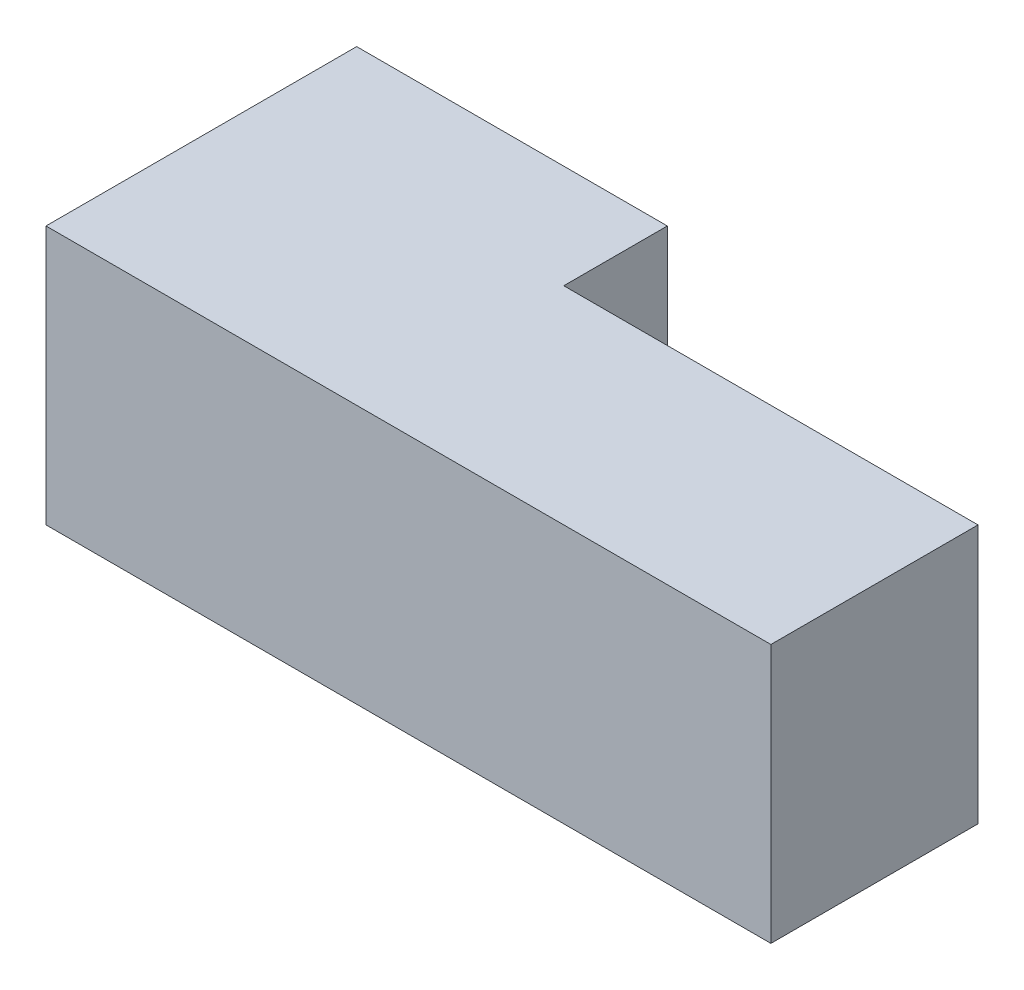
ISO-10303-21;
HEADER;
FILE_DESCRIPTION(('STEP AP214'),'2;1');
FILE_NAME('part.step','',(''),(''),'','','');
FILE_SCHEMA(('AUTOMOTIVE_DESIGN { 1 0 10303 214 1 1 1 1 }'));
ENDSEC;
DATA;
#1=APPLICATION_CONTEXT('core data for automotive mechanical design processes');
#2=APPLICATION_PROTOCOL_DEFINITION('international standard','automotive_design',2000,#1);
#3=PRODUCT_CONTEXT('',#1,'mechanical');
#4=PRODUCT('Part','Part','',(#3));
#5=PRODUCT_RELATED_PRODUCT_CATEGORY('part','',(#4));
#6=PRODUCT_DEFINITION_FORMATION('','',#4);
#7=PRODUCT_DEFINITION_CONTEXT('part definition',#1,'design');
#8=PRODUCT_DEFINITION('design','',#6,#7);
#9=PRODUCT_DEFINITION_SHAPE('','',#8);
#10=(LENGTH_UNIT() NAMED_UNIT(*) SI_UNIT(.MILLI.,.METRE.));
#11=(NAMED_UNIT(*) PLANE_ANGLE_UNIT() SI_UNIT($,.RADIAN.));
#12=(NAMED_UNIT(*) SI_UNIT($,.STERADIAN.) SOLID_ANGLE_UNIT());
#13=UNCERTAINTY_MEASURE_WITH_UNIT(LENGTH_MEASURE(1.E-05),#10,'distance_accuracy_value','');
#14=(GEOMETRIC_REPRESENTATION_CONTEXT(3) GLOBAL_UNCERTAINTY_ASSIGNED_CONTEXT((#13)) GLOBAL_UNIT_ASSIGNED_CONTEXT((#10,
#11,#12)) REPRESENTATION_CONTEXT('',''));
#15=CARTESIAN_POINT('',(0.,0.,0.));
#16=DIRECTION('',(0.,0.,1.));
#17=DIRECTION('',(1.,0.,0.));
#18=AXIS2_PLACEMENT_3D('',#15,#16,#17);
#19=CARTESIAN_POINT('',(0.,25.,0.));
#20=DIRECTION('',(1.,0.,0.));
#21=DIRECTION('',(0.,0.,-1.));
#22=AXIS2_PLACEMENT_3D('',#19,#20,#21);
#23=PLANE('',#22);
#24=DIRECTION('',(0.,0.,1.));
#25=VECTOR('',#24,1.);
#26=CARTESIAN_POINT('',(0.,0.,0.));
#27=LINE('',#26,#25);
#28=CARTESIAN_POINT('',(0.,0.,-30.));
#29=VERTEX_POINT('',#28);
#30=CARTESIAN_POINT('',(0.,0.,0.));
#31=VERTEX_POINT('',#30);
#32=EDGE_CURVE('E128',#29,#31,#27,.T.);
#33=ORIENTED_EDGE('',*,*,#32,.T.);
#34=DIRECTION('',(0.,-1.,0.));
#35=VECTOR('',#34,1.);
#36=CARTESIAN_POINT('',(0.,25.,0.));
#37=LINE('',#36,#35);
#38=CARTESIAN_POINT('',(0.,25.,0.));
#39=VERTEX_POINT('',#38);
#40=EDGE_CURVE('E11',#39,#31,#37,.T.);
#41=ORIENTED_EDGE('',*,*,#40,.F.);
#42=DIRECTION('',(0.,0.,1.));
#43=VECTOR('',#42,1.);
#44=CARTESIAN_POINT('',(0.,25.,0.));
#45=LINE('',#44,#43);
#46=CARTESIAN_POINT('',(0.,25.,-30.));
#47=VERTEX_POINT('',#46);
#48=EDGE_CURVE('E144',#47,#39,#45,.T.);
#49=ORIENTED_EDGE('',*,*,#48,.F.);
#50=DIRECTION('',(0.,-1.,0.));
#51=VECTOR('',#50,1.);
#52=CARTESIAN_POINT('',(0.,25.,-30.));
#53=LINE('',#52,#51);
#54=EDGE_CURVE('E124',#47,#29,#53,.T.);
#55=ORIENTED_EDGE('',*,*,#54,.T.);
#56=EDGE_LOOP('',(#33,#41,#49,#55));
#57=FACE_BOUND('',#56,.T.);
#58=ADVANCED_FACE('F39',(#57),#23,.F.);
#59=CARTESIAN_POINT('',(0.,25.,0.));
#60=DIRECTION('',(0.,0.,-1.));
#61=DIRECTION('',(-1.,0.,0.));
#62=AXIS2_PLACEMENT_3D('',#59,#60,#61);
#63=PLANE('',#62);
#64=DIRECTION('',(1.,0.,0.));
#65=VECTOR('',#64,1.);
#66=CARTESIAN_POINT('',(0.,0.,0.));
#67=LINE('',#66,#65);
#68=CARTESIAN_POINT('',(70.,0.,0.));
#69=VERTEX_POINT('',#68);
#70=EDGE_CURVE('E132',#31,#69,#67,.T.);
#71=ORIENTED_EDGE('',*,*,#70,.T.);
#72=DIRECTION('',(0.,-1.,0.));
#73=VECTOR('',#72,1.);
#74=CARTESIAN_POINT('',(70.,25.,0.));
#75=LINE('',#74,#73);
#76=CARTESIAN_POINT('',(70.,25.,0.));
#77=VERTEX_POINT('',#76);
#78=EDGE_CURVE('E48',#77,#69,#75,.T.);
#79=ORIENTED_EDGE('',*,*,#78,.F.);
#80=DIRECTION('',(1.,0.,0.));
#81=VECTOR('',#80,1.);
#82=CARTESIAN_POINT('',(0.,25.,0.));
#83=LINE('',#82,#81);
#84=EDGE_CURVE('E93',#39,#77,#83,.T.);
#85=ORIENTED_EDGE('',*,*,#84,.F.);
#86=ORIENTED_EDGE('',*,*,#40,.T.);
#87=EDGE_LOOP('',(#71,#79,#85,#86));
#88=FACE_BOUND('',#87,.T.);
#89=ADVANCED_FACE('F172',(#88),#63,.F.);
#90=CARTESIAN_POINT('',(70.,25.,0.));
#91=DIRECTION('',(-1.,0.,0.));
#92=DIRECTION('',(0.,0.,1.));
#93=AXIS2_PLACEMENT_3D('',#90,#91,#92);
#94=PLANE('',#93);
#95=DIRECTION('',(0.,0.,-1.));
#96=VECTOR('',#95,1.);
#97=CARTESIAN_POINT('',(70.,0.,0.));
#98=LINE('',#97,#96);
#99=CARTESIAN_POINT('',(70.,0.,-20.));
#100=VERTEX_POINT('',#99);
#101=EDGE_CURVE('E135',#69,#100,#98,.T.);
#102=ORIENTED_EDGE('',*,*,#101,.T.);
#103=DIRECTION('',(0.,-1.,0.));
#104=VECTOR('',#103,1.);
#105=CARTESIAN_POINT('',(70.,25.,-20.));
#106=LINE('',#105,#104);
#107=CARTESIAN_POINT('',(70.,25.,-20.));
#108=VERTEX_POINT('',#107);
#109=EDGE_CURVE('E117',#108,#100,#106,.T.);
#110=ORIENTED_EDGE('',*,*,#109,.F.);
#111=DIRECTION('',(0.,0.,-1.));
#112=VECTOR('',#111,1.);
#113=CARTESIAN_POINT('',(70.,25.,0.));
#114=LINE('',#113,#112);
#115=EDGE_CURVE('E106',#77,#108,#114,.T.);
#116=ORIENTED_EDGE('',*,*,#115,.F.);
#117=ORIENTED_EDGE('',*,*,#78,.T.);
#118=EDGE_LOOP('',(#102,#110,#116,#117));
#119=FACE_BOUND('',#118,.T.);
#120=ADVANCED_FACE('F154',(#119),#94,.F.);
#121=CARTESIAN_POINT('',(30.,25.,-20.));
#122=DIRECTION('',(0.,0.,1.));
#123=DIRECTION('',(1.,0.,0.));
#124=AXIS2_PLACEMENT_3D('',#121,#122,#123);
#125=PLANE('',#124);
#126=DIRECTION('',(-1.,0.,0.));
#127=VECTOR('',#126,1.);
#128=CARTESIAN_POINT('',(30.,0.,-20.));
#129=LINE('',#128,#127);
#130=CARTESIAN_POINT('',(30.,0.,-20.));
#131=VERTEX_POINT('',#130);
#132=EDGE_CURVE('E115',#100,#131,#129,.T.);
#133=ORIENTED_EDGE('',*,*,#132,.T.);
#134=DIRECTION('',(0.,-1.,0.));
#135=VECTOR('',#134,1.);
#136=CARTESIAN_POINT('',(30.,25.,-20.));
#137=LINE('',#136,#135);
#138=CARTESIAN_POINT('',(30.,25.,-20.));
#139=VERTEX_POINT('',#138);
#140=EDGE_CURVE('E112',#139,#131,#137,.T.);
#141=ORIENTED_EDGE('',*,*,#140,.F.);
#142=DIRECTION('',(-1.,0.,0.));
#143=VECTOR('',#142,1.);
#144=CARTESIAN_POINT('',(30.,25.,-20.));
#145=LINE('',#144,#143);
#146=EDGE_CURVE('E100',#108,#139,#145,.T.);
#147=ORIENTED_EDGE('',*,*,#146,.F.);
#148=ORIENTED_EDGE('',*,*,#109,.T.);
#149=EDGE_LOOP('',(#133,#141,#147,#148));
#150=FACE_BOUND('',#149,.T.);
#151=ADVANCED_FACE('F113',(#150),#125,.F.);
#152=CARTESIAN_POINT('',(30.,25.,-30.));
#153=DIRECTION('',(-1.,0.,0.));
#154=DIRECTION('',(0.,0.,1.));
#155=AXIS2_PLACEMENT_3D('',#152,#153,#154);
#156=PLANE('',#155);
#157=DIRECTION('',(0.,0.,-1.));
#158=VECTOR('',#157,1.);
#159=CARTESIAN_POINT('',(30.,0.,-30.));
#160=LINE('',#159,#158);
#161=CARTESIAN_POINT('',(30.,0.,-30.));
#162=VERTEX_POINT('',#161);
#163=EDGE_CURVE('E79',#131,#162,#160,.T.);
#164=ORIENTED_EDGE('',*,*,#163,.T.);
#165=DIRECTION('',(0.,-1.,0.));
#166=VECTOR('',#165,1.);
#167=CARTESIAN_POINT('',(30.,25.,-30.));
#168=LINE('',#167,#166);
#169=CARTESIAN_POINT('',(30.,25.,-30.));
#170=VERTEX_POINT('',#169);
#171=EDGE_CURVE('E118',#170,#162,#168,.T.);
#172=ORIENTED_EDGE('',*,*,#171,.F.);
#173=DIRECTION('',(0.,0.,-1.));
#174=VECTOR('',#173,1.);
#175=CARTESIAN_POINT('',(30.,25.,-30.));
#176=LINE('',#175,#174);
#177=EDGE_CURVE('E104',#139,#170,#176,.T.);
#178=ORIENTED_EDGE('',*,*,#177,.F.);
#179=ORIENTED_EDGE('',*,*,#140,.T.);
#180=EDGE_LOOP('',(#164,#172,#178,#179));
#181=FACE_BOUND('',#180,.T.);
#182=ADVANCED_FACE('F120',(#181),#156,.F.);
#183=CARTESIAN_POINT('',(0.,25.,-30.));
#184=DIRECTION('',(0.,0.,1.));
#185=DIRECTION('',(1.,0.,0.));
#186=AXIS2_PLACEMENT_3D('',#183,#184,#185);
#187=PLANE('',#186);
#188=DIRECTION('',(-1.,0.,0.));
#189=VECTOR('',#188,1.);
#190=CARTESIAN_POINT('',(0.,0.,-30.));
#191=LINE('',#190,#189);
#192=EDGE_CURVE('E85',#162,#29,#191,.T.);
#193=ORIENTED_EDGE('',*,*,#192,.T.);
#194=ORIENTED_EDGE('',*,*,#54,.F.);
#195=DIRECTION('',(-1.,0.,0.));
#196=VECTOR('',#195,1.);
#197=CARTESIAN_POINT('',(0.,25.,-30.));
#198=LINE('',#197,#196);
#199=EDGE_CURVE('E56',#170,#47,#198,.T.);
#200=ORIENTED_EDGE('',*,*,#199,.F.);
#201=ORIENTED_EDGE('',*,*,#171,.T.);
#202=EDGE_LOOP('',(#193,#194,#200,#201));
#203=FACE_BOUND('',#202,.T.);
#204=ADVANCED_FACE('F161',(#203),#187,.F.);
#205=CARTESIAN_POINT('',(0.,25.,0.));
#206=DIRECTION('',(0.,-1.,0.));
#207=DIRECTION('',(0.,0.,-1.));
#208=AXIS2_PLACEMENT_3D('',#205,#206,#207);
#209=PLANE('',#208);
#210=ORIENTED_EDGE('',*,*,#48,.T.);
#211=ORIENTED_EDGE('',*,*,#84,.T.);
#212=ORIENTED_EDGE('',*,*,#115,.T.);
#213=ORIENTED_EDGE('',*,*,#146,.T.);
#214=ORIENTED_EDGE('',*,*,#177,.T.);
#215=ORIENTED_EDGE('',*,*,#199,.T.);
#216=EDGE_LOOP('',(#210,#211,#212,#213,#214,#215));
#217=FACE_BOUND('',#216,.T.);
#218=ADVANCED_FACE('F102',(#217),#209,.F.);
#219=CARTESIAN_POINT('',(0.,0.,0.));
#220=DIRECTION('',(0.,-1.,0.));
#221=DIRECTION('',(0.,0.,-1.));
#222=AXIS2_PLACEMENT_3D('',#219,#220,#221);
#223=PLANE('',#222);
#224=ORIENTED_EDGE('',*,*,#32,.F.);
#225=ORIENTED_EDGE('',*,*,#192,.F.);
#226=ORIENTED_EDGE('',*,*,#163,.F.);
#227=ORIENTED_EDGE('',*,*,#132,.F.);
#228=ORIENTED_EDGE('',*,*,#101,.F.);
#229=ORIENTED_EDGE('',*,*,#70,.F.);
#230=EDGE_LOOP('',(#224,#225,#226,#227,#228,#229));
#231=FACE_BOUND('',#230,.T.);
#232=ADVANCED_FACE('F157',(#231),#223,.T.);
#233=CLOSED_SHELL('',(#58,#89,#120,#151,#182,#204,#218,#232));
#234=MANIFOLD_SOLID_BREP('B2',#233);
#235=ADVANCED_BREP_SHAPE_REPRESENTATION('',(#18,#234),#14);
#236=SHAPE_DEFINITION_REPRESENTATION(#9,#235);
ENDSEC;
END-ISO-10303-21;
